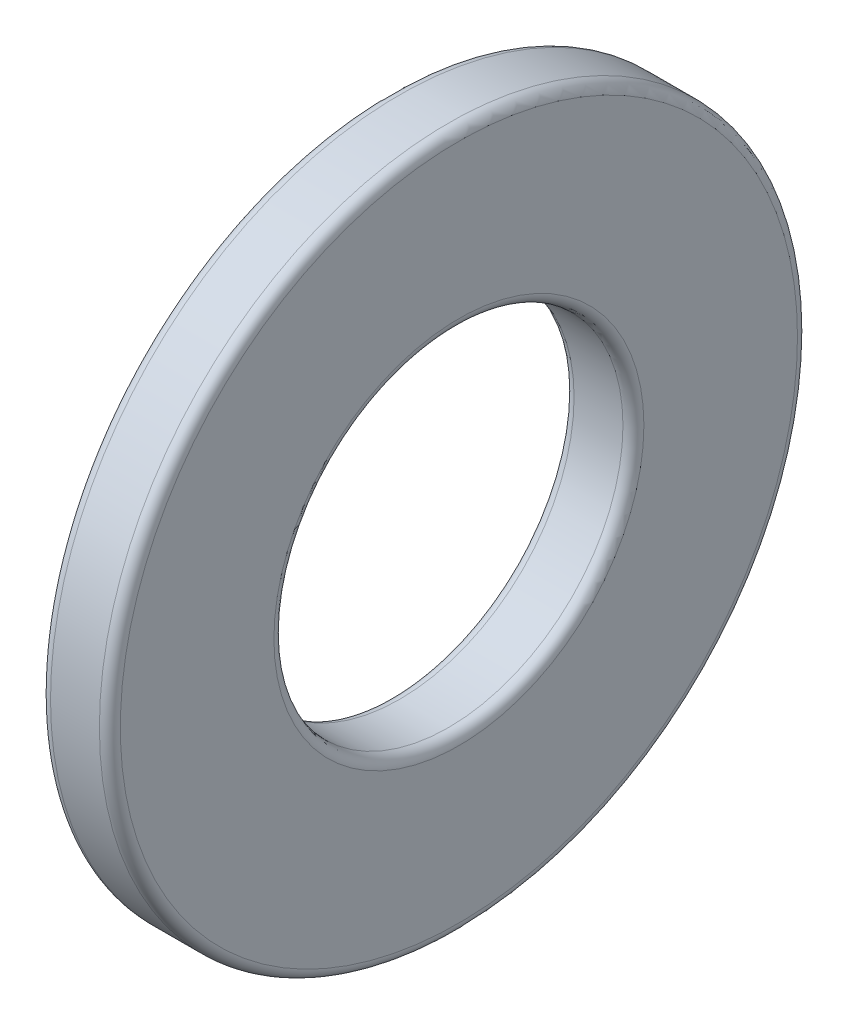
ISO-10303-21;
HEADER;
FILE_DESCRIPTION(('STEP AP214'),'2;1');
FILE_NAME('part.step','',(''),(''),'','','');
FILE_SCHEMA(('AUTOMOTIVE_DESIGN { 1 0 10303 214 1 1 1 1 }'));
ENDSEC;
DATA;
#1=APPLICATION_CONTEXT('core data for automotive mechanical design processes');
#2=APPLICATION_PROTOCOL_DEFINITION('international standard','automotive_design',2000,#1);
#3=PRODUCT_CONTEXT('',#1,'mechanical');
#4=PRODUCT('Part','Part','',(#3));
#5=PRODUCT_RELATED_PRODUCT_CATEGORY('part','',(#4));
#6=PRODUCT_DEFINITION_FORMATION('','',#4);
#7=PRODUCT_DEFINITION_CONTEXT('part definition',#1,'design');
#8=PRODUCT_DEFINITION('design','',#6,#7);
#9=PRODUCT_DEFINITION_SHAPE('','',#8);
#10=(LENGTH_UNIT() NAMED_UNIT(*) SI_UNIT(.MILLI.,.METRE.));
#11=(NAMED_UNIT(*) PLANE_ANGLE_UNIT() SI_UNIT($,.RADIAN.));
#12=(NAMED_UNIT(*) SI_UNIT($,.STERADIAN.) SOLID_ANGLE_UNIT());
#13=UNCERTAINTY_MEASURE_WITH_UNIT(LENGTH_MEASURE(1.E-05),#10,'distance_accuracy_value','');
#14=(GEOMETRIC_REPRESENTATION_CONTEXT(3) GLOBAL_UNCERTAINTY_ASSIGNED_CONTEXT((#13)) GLOBAL_UNIT_ASSIGNED_CONTEXT((#10,
#11,#12)) REPRESENTATION_CONTEXT('',''));
#15=CARTESIAN_POINT('',(0.,0.,0.));
#16=DIRECTION('',(0.,0.,1.));
#17=DIRECTION('',(1.,0.,0.));
#18=AXIS2_PLACEMENT_3D('',#15,#16,#17);
#19=CARTESIAN_POINT('',(1.,0.,0.));
#20=DIRECTION('',(1.,0.,0.));
#21=DIRECTION('',(0.,0.,-1.));
#22=AXIS2_PLACEMENT_3D('',#19,#20,#21);
#23=PLANE('',#22);
#24=CARTESIAN_POINT('',(1.,0.,0.));
#25=DIRECTION('',(1.,0.,0.));
#26=DIRECTION('',(0.,0.,-1.));
#27=AXIS2_PLACEMENT_3D('',#24,#25,#26);
#28=CIRCLE('',#27,2.65);
#29=CARTESIAN_POINT('',(1.,0.,-2.65));
#30=VERTEX_POINT('',#29);
#31=EDGE_CURVE('E10',#30,#30,#28,.F.);
#32=ORIENTED_EDGE('',*,*,#31,.T.);
#33=EDGE_LOOP('',(#32));
#34=FACE_BOUND('',#33,.T.);
#35=CARTESIAN_POINT('',(1.,0.,0.));
#36=DIRECTION('',(1.,0.,0.));
#37=DIRECTION('',(0.,0.,-1.));
#38=AXIS2_PLACEMENT_3D('',#35,#36,#37);
#39=CIRCLE('',#38,4.85);
#40=CARTESIAN_POINT('',(1.,0.,-4.85));
#41=VERTEX_POINT('',#40);
#42=EDGE_CURVE('E37',#41,#41,#39,.T.);
#43=ORIENTED_EDGE('',*,*,#42,.T.);
#44=EDGE_LOOP('',(#43));
#45=FACE_BOUND('',#44,.T.);
#46=ADVANCED_FACE('F30',(#34,#45),#23,.T.);
#47=CARTESIAN_POINT('',(0.,0.,0.));
#48=DIRECTION('',(1.,0.,0.));
#49=DIRECTION('',(0.,0.,-1.));
#50=AXIS2_PLACEMENT_3D('',#47,#48,#49);
#51=PLANE('',#50);
#52=CARTESIAN_POINT('',(0.,0.,0.));
#53=DIRECTION('',(1.,0.,0.));
#54=DIRECTION('',(0.,0.,-1.));
#55=AXIS2_PLACEMENT_3D('',#52,#53,#54);
#56=CIRCLE('',#55,2.65);
#57=CARTESIAN_POINT('',(0.,0.,-2.65));
#58=VERTEX_POINT('',#57);
#59=EDGE_CURVE('E56',#58,#58,#56,.T.);
#60=ORIENTED_EDGE('',*,*,#59,.T.);
#61=EDGE_LOOP('',(#60));
#62=FACE_BOUND('',#61,.T.);
#63=CARTESIAN_POINT('',(0.,0.,0.));
#64=DIRECTION('',(1.,0.,0.));
#65=DIRECTION('',(0.,0.,-1.));
#66=AXIS2_PLACEMENT_3D('',#63,#64,#65);
#67=CIRCLE('',#66,4.85);
#68=CARTESIAN_POINT('',(0.,0.,-4.85));
#69=VERTEX_POINT('',#68);
#70=EDGE_CURVE('E59',#69,#69,#67,.F.);
#71=ORIENTED_EDGE('',*,*,#70,.T.);
#72=EDGE_LOOP('',(#71));
#73=FACE_BOUND('',#72,.T.);
#74=ADVANCED_FACE('F63',(#62,#73),#51,.F.);
#75=CARTESIAN_POINT('',(1.,0.,0.));
#76=DIRECTION('',(-1.,0.,0.));
#77=DIRECTION('',(0.,0.,1.));
#78=AXIS2_PLACEMENT_3D('',#75,#76,#77);
#79=CYLINDRICAL_SURFACE('',#78,5.);
#80=CARTESIAN_POINT('',(0.15,0.,0.));
#81=DIRECTION('',(1.,0.,0.));
#82=DIRECTION('',(0.,0.,-1.));
#83=AXIS2_PLACEMENT_3D('',#80,#81,#82);
#84=CIRCLE('',#83,5.);
#85=CARTESIAN_POINT('',(0.15,0.,-5.));
#86=VERTEX_POINT('',#85);
#87=EDGE_CURVE('E41',#86,#86,#84,.T.);
#88=ORIENTED_EDGE('',*,*,#87,.T.);
#89=EDGE_LOOP('',(#88));
#90=FACE_BOUND('',#89,.T.);
#91=CARTESIAN_POINT('',(0.85,0.,0.));
#92=DIRECTION('',(1.,0.,0.));
#93=DIRECTION('',(0.,0.,-1.));
#94=AXIS2_PLACEMENT_3D('',#91,#92,#93);
#95=CIRCLE('',#94,5.);
#96=CARTESIAN_POINT('',(0.85,0.,-5.));
#97=VERTEX_POINT('',#96);
#98=EDGE_CURVE('E45',#97,#97,#95,.F.);
#99=ORIENTED_EDGE('',*,*,#98,.T.);
#100=EDGE_LOOP('',(#99));
#101=FACE_BOUND('',#100,.T.);
#102=ADVANCED_FACE('F73',(#90,#101),#79,.T.);
#103=CARTESIAN_POINT('',(1.,0.,0.));
#104=DIRECTION('',(-1.,0.,0.));
#105=DIRECTION('',(0.,0.,1.));
#106=AXIS2_PLACEMENT_3D('',#103,#104,#105);
#107=CYLINDRICAL_SURFACE('',#106,2.5);
#108=CARTESIAN_POINT('',(0.15,0.,0.));
#109=DIRECTION('',(1.,0.,0.));
#110=DIRECTION('',(0.,0.,-1.));
#111=AXIS2_PLACEMENT_3D('',#108,#109,#110);
#112=CIRCLE('',#111,2.5);
#113=CARTESIAN_POINT('',(0.15,0.,-2.5));
#114=VERTEX_POINT('',#113);
#115=EDGE_CURVE('E50',#114,#114,#112,.F.);
#116=ORIENTED_EDGE('',*,*,#115,.T.);
#117=EDGE_LOOP('',(#116));
#118=FACE_BOUND('',#117,.T.);
#119=CARTESIAN_POINT('',(0.85,0.,0.));
#120=DIRECTION('',(1.,0.,0.));
#121=DIRECTION('',(0.,0.,-1.));
#122=AXIS2_PLACEMENT_3D('',#119,#120,#121);
#123=CIRCLE('',#122,2.5);
#124=CARTESIAN_POINT('',(0.85,0.,-2.5));
#125=VERTEX_POINT('',#124);
#126=EDGE_CURVE('E53',#125,#125,#123,.T.);
#127=ORIENTED_EDGE('',*,*,#126,.T.);
#128=EDGE_LOOP('',(#127));
#129=FACE_BOUND('',#128,.T.);
#130=ADVANCED_FACE('F76',(#118,#129),#107,.F.);
#131=CARTESIAN_POINT('',(0.15,0.,0.));
#132=DIRECTION('',(1.,0.,0.));
#133=DIRECTION('',(0.,0.,-1.));
#134=AXIS2_PLACEMENT_3D('',#131,#132,#133);
#135=TOROIDAL_SURFACE('',#134,2.65,0.15);
#136=ORIENTED_EDGE('',*,*,#115,.F.);
#137=EDGE_LOOP('',(#136));
#138=FACE_BOUND('',#137,.T.);
#139=ORIENTED_EDGE('',*,*,#59,.F.);
#140=EDGE_LOOP('',(#139));
#141=FACE_BOUND('',#140,.T.);
#142=ADVANCED_FACE('F69',(#138,#141),#135,.T.);
#143=CARTESIAN_POINT('',(0.15,0.,0.));
#144=DIRECTION('',(1.,0.,0.));
#145=DIRECTION('',(0.,0.,-1.));
#146=AXIS2_PLACEMENT_3D('',#143,#144,#145);
#147=TOROIDAL_SURFACE('',#146,4.85,0.15);
#148=ORIENTED_EDGE('',*,*,#70,.F.);
#149=EDGE_LOOP('',(#148));
#150=FACE_BOUND('',#149,.T.);
#151=ORIENTED_EDGE('',*,*,#87,.F.);
#152=EDGE_LOOP('',(#151));
#153=FACE_BOUND('',#152,.T.);
#154=ADVANCED_FACE('F65',(#150,#153),#147,.T.);
#155=CARTESIAN_POINT('',(0.85,0.,0.));
#156=DIRECTION('',(1.,0.,0.));
#157=DIRECTION('',(0.,0.,-1.));
#158=AXIS2_PLACEMENT_3D('',#155,#156,#157);
#159=TOROIDAL_SURFACE('',#158,2.65,0.15);
#160=ORIENTED_EDGE('',*,*,#31,.F.);
#161=EDGE_LOOP('',(#160));
#162=FACE_BOUND('',#161,.T.);
#163=ORIENTED_EDGE('',*,*,#126,.F.);
#164=EDGE_LOOP('',(#163));
#165=FACE_BOUND('',#164,.T.);
#166=ADVANCED_FACE('F68',(#162,#165),#159,.T.);
#167=CARTESIAN_POINT('',(0.85,0.,0.));
#168=DIRECTION('',(1.,0.,0.));
#169=DIRECTION('',(0.,0.,-1.));
#170=AXIS2_PLACEMENT_3D('',#167,#168,#169);
#171=TOROIDAL_SURFACE('',#170,4.85,0.15);
#172=ORIENTED_EDGE('',*,*,#98,.F.);
#173=EDGE_LOOP('',(#172));
#174=FACE_BOUND('',#173,.T.);
#175=ORIENTED_EDGE('',*,*,#42,.F.);
#176=EDGE_LOOP('',(#175));
#177=FACE_BOUND('',#176,.T.);
#178=ADVANCED_FACE('F32',(#174,#177),#171,.T.);
#179=CLOSED_SHELL('',(#46,#74,#102,#130,#142,#154,#166,#178));
#180=MANIFOLD_SOLID_BREP('B2',#179);
#181=ADVANCED_BREP_SHAPE_REPRESENTATION('',(#18,#180),#14);
#182=SHAPE_DEFINITION_REPRESENTATION(#9,#181);
ENDSEC;
END-ISO-10303-21;
